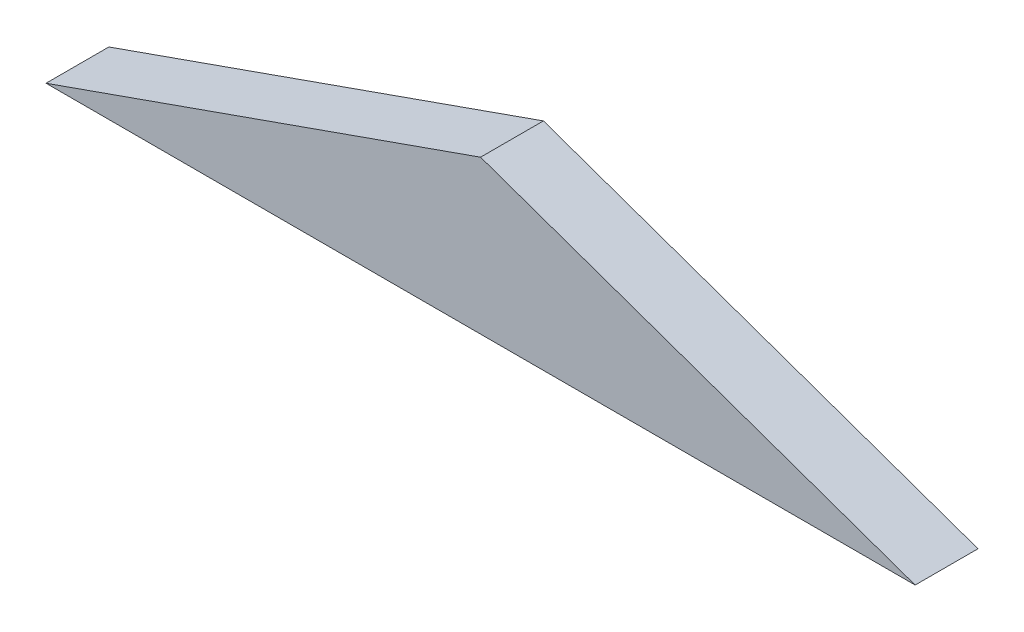
ISO-10303-21;
HEADER;
FILE_DESCRIPTION(('STEP AP214'),'2;1');
FILE_NAME('part.step','',(''),(''),'','','');
FILE_SCHEMA(('AUTOMOTIVE_DESIGN { 1 0 10303 214 1 1 1 1 }'));
ENDSEC;
DATA;
#1=APPLICATION_CONTEXT('core data for automotive mechanical design processes');
#2=APPLICATION_PROTOCOL_DEFINITION('international standard','automotive_design',2000,#1);
#3=PRODUCT_CONTEXT('',#1,'mechanical');
#4=PRODUCT('Part','Part','',(#3));
#5=PRODUCT_RELATED_PRODUCT_CATEGORY('part','',(#4));
#6=PRODUCT_DEFINITION_FORMATION('','',#4);
#7=PRODUCT_DEFINITION_CONTEXT('part definition',#1,'design');
#8=PRODUCT_DEFINITION('design','',#6,#7);
#9=PRODUCT_DEFINITION_SHAPE('','',#8);
#10=(LENGTH_UNIT() NAMED_UNIT(*) SI_UNIT(.MILLI.,.METRE.));
#11=(NAMED_UNIT(*) PLANE_ANGLE_UNIT() SI_UNIT($,.RADIAN.));
#12=(NAMED_UNIT(*) SI_UNIT($,.STERADIAN.) SOLID_ANGLE_UNIT());
#13=UNCERTAINTY_MEASURE_WITH_UNIT(LENGTH_MEASURE(1.E-05),#10,'distance_accuracy_value','');
#14=(GEOMETRIC_REPRESENTATION_CONTEXT(3) GLOBAL_UNCERTAINTY_ASSIGNED_CONTEXT((#13)) GLOBAL_UNIT_ASSIGNED_CONTEXT((#10,
#11,#12)) REPRESENTATION_CONTEXT('',''));
#15=CARTESIAN_POINT('',(0.,0.,0.));
#16=DIRECTION('',(0.,0.,1.));
#17=DIRECTION('',(1.,0.,0.));
#18=AXIS2_PLACEMENT_3D('',#15,#16,#17);
#19=CARTESIAN_POINT('',(0.,110.,3.));
#20=DIRECTION('',(-0.332564562644353,-0.943080490559088,0.));
#21=DIRECTION('',(0.943080490559088,-0.332564562644353,0.));
#22=AXIS2_PLACEMENT_3D('',#19,#20,#21);
#23=PLANE('',#22);
#24=DIRECTION('',(-0.943080490559088,0.332564562644353,0.));
#25=VECTOR('',#24,1.);
#26=CARTESIAN_POINT('',(0.,110.,0.));
#27=LINE('',#26,#25);
#28=CARTESIAN_POINT('',(20.7477707922999,102.683579621824,0.));
#29=VERTEX_POINT('',#28);
#30=CARTESIAN_POINT('',(0.,110.,0.));
#31=VERTEX_POINT('',#30);
#32=EDGE_CURVE('E80',#29,#31,#27,.T.);
#33=ORIENTED_EDGE('',*,*,#32,.T.);
#34=DIRECTION('',(0.,0.,-1.));
#35=VECTOR('',#34,1.);
#36=CARTESIAN_POINT('',(0.,110.,3.));
#37=LINE('',#36,#35);
#38=CARTESIAN_POINT('',(0.,110.,3.));
#39=VERTEX_POINT('',#38);
#40=EDGE_CURVE('E11',#39,#31,#37,.T.);
#41=ORIENTED_EDGE('',*,*,#40,.F.);
#42=DIRECTION('',(-0.943080490559088,0.332564562644353,0.));
#43=VECTOR('',#42,1.);
#44=CARTESIAN_POINT('',(0.,110.,3.));
#45=LINE('',#44,#43);
#46=CARTESIAN_POINT('',(20.7477707922999,102.683579621824,3.));
#47=VERTEX_POINT('',#46);
#48=EDGE_CURVE('E73',#47,#39,#45,.T.);
#49=ORIENTED_EDGE('',*,*,#48,.F.);
#50=DIRECTION('',(0.,0.,-1.));
#51=VECTOR('',#50,1.);
#52=CARTESIAN_POINT('',(20.7477707922999,102.683579621824,3.));
#53=LINE('',#52,#51);
#54=EDGE_CURVE('E81',#47,#29,#53,.T.);
#55=ORIENTED_EDGE('',*,*,#54,.T.);
#56=EDGE_LOOP('',(#33,#41,#49,#55));
#57=FACE_BOUND('',#56,.T.);
#58=ADVANCED_FACE('F33',(#57),#23,.F.);
#59=CARTESIAN_POINT('',(0.,110.,3.));
#60=DIRECTION('',(0.332564562644353,-0.943080490559088,0.));
#61=DIRECTION('',(0.943080490559088,0.332564562644353,0.));
#62=AXIS2_PLACEMENT_3D('',#59,#60,#61);
#63=PLANE('',#62);
#64=DIRECTION('',(-0.943080490559088,-0.332564562644353,0.));
#65=VECTOR('',#64,1.);
#66=CARTESIAN_POINT('',(0.,110.,0.));
#67=LINE('',#66,#65);
#68=CARTESIAN_POINT('',(-20.7477707922999,102.683579621824,0.));
#69=VERTEX_POINT('',#68);
#70=EDGE_CURVE('E61',#31,#69,#67,.T.);
#71=ORIENTED_EDGE('',*,*,#70,.T.);
#72=DIRECTION('',(0.,0.,-1.));
#73=VECTOR('',#72,1.);
#74=CARTESIAN_POINT('',(-20.7477707922999,102.683579621824,3.));
#75=LINE('',#74,#73);
#76=CARTESIAN_POINT('',(-20.7477707922999,102.683579621824,3.));
#77=VERTEX_POINT('',#76);
#78=EDGE_CURVE('E41',#77,#69,#75,.T.);
#79=ORIENTED_EDGE('',*,*,#78,.F.);
#80=DIRECTION('',(-0.943080490559088,-0.332564562644353,0.));
#81=VECTOR('',#80,1.);
#82=CARTESIAN_POINT('',(0.,110.,3.));
#83=LINE('',#82,#81);
#84=EDGE_CURVE('E69',#39,#77,#83,.T.);
#85=ORIENTED_EDGE('',*,*,#84,.F.);
#86=ORIENTED_EDGE('',*,*,#40,.T.);
#87=EDGE_LOOP('',(#71,#79,#85,#86));
#88=FACE_BOUND('',#87,.T.);
#89=ADVANCED_FACE('F70',(#88),#63,.F.);
#90=CARTESIAN_POINT('',(-20.7477707922999,102.683579621824,3.));
#91=DIRECTION('',(0.,1.,0.));
#92=DIRECTION('',(0.,0.,1.));
#93=AXIS2_PLACEMENT_3D('',#90,#91,#92);
#94=PLANE('',#93);
#95=DIRECTION('',(1.,0.,0.));
#96=VECTOR('',#95,1.);
#97=CARTESIAN_POINT('',(-20.7477707922999,102.683579621824,0.));
#98=LINE('',#97,#96);
#99=EDGE_CURVE('E66',#69,#29,#98,.T.);
#100=ORIENTED_EDGE('',*,*,#99,.T.);
#101=ORIENTED_EDGE('',*,*,#54,.F.);
#102=DIRECTION('',(1.,0.,0.));
#103=VECTOR('',#102,1.);
#104=CARTESIAN_POINT('',(-20.7477707922999,102.683579621824,3.));
#105=LINE('',#104,#103);
#106=EDGE_CURVE('E49',#77,#47,#105,.T.);
#107=ORIENTED_EDGE('',*,*,#106,.F.);
#108=ORIENTED_EDGE('',*,*,#78,.T.);
#109=EDGE_LOOP('',(#100,#101,#107,#108));
#110=FACE_BOUND('',#109,.T.);
#111=ADVANCED_FACE('F88',(#110),#94,.F.);
#112=CARTESIAN_POINT('',(0.,0.,3.));
#113=DIRECTION('',(0.,0.,-1.));
#114=DIRECTION('',(-1.,0.,0.));
#115=AXIS2_PLACEMENT_3D('',#112,#113,#114);
#116=PLANE('',#115);
#117=ORIENTED_EDGE('',*,*,#48,.T.);
#118=ORIENTED_EDGE('',*,*,#84,.T.);
#119=ORIENTED_EDGE('',*,*,#106,.T.);
#120=EDGE_LOOP('',(#117,#118,#119));
#121=FACE_BOUND('',#120,.T.);
#122=ADVANCED_FACE('F76',(#121),#116,.F.);
#123=CARTESIAN_POINT('',(0.,0.,0.));
#124=DIRECTION('',(0.,0.,-1.));
#125=DIRECTION('',(-1.,0.,0.));
#126=AXIS2_PLACEMENT_3D('',#123,#124,#125);
#127=PLANE('',#126);
#128=ORIENTED_EDGE('',*,*,#32,.F.);
#129=ORIENTED_EDGE('',*,*,#99,.F.);
#130=ORIENTED_EDGE('',*,*,#70,.F.);
#131=EDGE_LOOP('',(#128,#129,#130));
#132=FACE_BOUND('',#131,.T.);
#133=ADVANCED_FACE('F89',(#132),#127,.T.);
#134=CLOSED_SHELL('',(#58,#89,#111,#122,#133));
#135=MANIFOLD_SOLID_BREP('B2',#134);
#136=ADVANCED_BREP_SHAPE_REPRESENTATION('',(#18,#135),#14);
#137=SHAPE_DEFINITION_REPRESENTATION(#9,#136);
ENDSEC;
END-ISO-10303-21;
